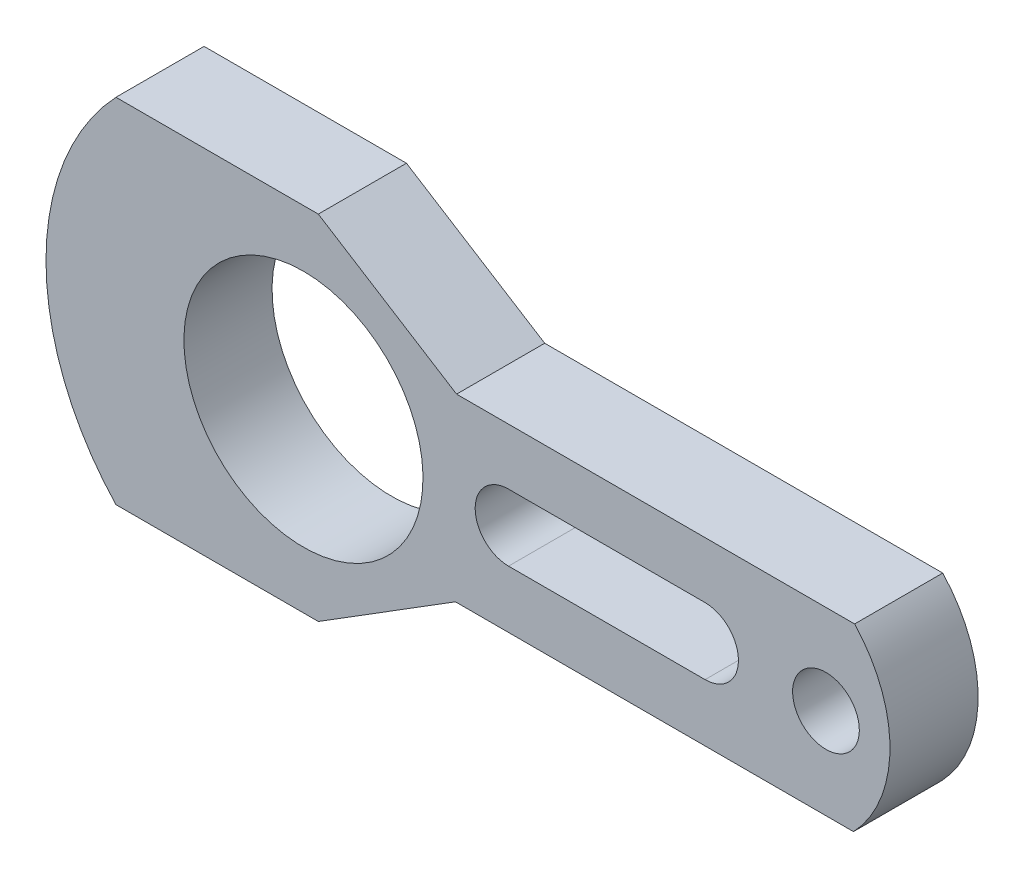
ISO-10303-21;
HEADER;
FILE_DESCRIPTION(('STEP AP214'),'2;1');
FILE_NAME('part.step','',(''),(''),'','','');
FILE_SCHEMA(('AUTOMOTIVE_DESIGN { 1 0 10303 214 1 1 1 1 }'));
ENDSEC;
DATA;
#1=APPLICATION_CONTEXT('core data for automotive mechanical design processes');
#2=APPLICATION_PROTOCOL_DEFINITION('international standard','automotive_design',2000,#1);
#3=PRODUCT_CONTEXT('',#1,'mechanical');
#4=PRODUCT('Part','Part','',(#3));
#5=PRODUCT_RELATED_PRODUCT_CATEGORY('part','',(#4));
#6=PRODUCT_DEFINITION_FORMATION('','',#4);
#7=PRODUCT_DEFINITION_CONTEXT('part definition',#1,'design');
#8=PRODUCT_DEFINITION('design','',#6,#7);
#9=PRODUCT_DEFINITION_SHAPE('','',#8);
#10=(LENGTH_UNIT() NAMED_UNIT(*) SI_UNIT(.MILLI.,.METRE.));
#11=(NAMED_UNIT(*) PLANE_ANGLE_UNIT() SI_UNIT($,.RADIAN.));
#12=(NAMED_UNIT(*) SI_UNIT($,.STERADIAN.) SOLID_ANGLE_UNIT());
#13=UNCERTAINTY_MEASURE_WITH_UNIT(LENGTH_MEASURE(1.E-05),#10,'distance_accuracy_value','');
#14=(GEOMETRIC_REPRESENTATION_CONTEXT(3) GLOBAL_UNCERTAINTY_ASSIGNED_CONTEXT((#13)) GLOBAL_UNIT_ASSIGNED_CONTEXT((#10,
#11,#12)) REPRESENTATION_CONTEXT('',''));
#15=CARTESIAN_POINT('',(0.,0.,0.));
#16=DIRECTION('',(0.,0.,1.));
#17=DIRECTION('',(1.,0.,0.));
#18=AXIS2_PLACEMENT_3D('',#15,#16,#17);
#19=CARTESIAN_POINT('',(258.318,9.51433274175042E-13,50.));
#20=DIRECTION('',(0.,0.,1.));
#21=DIRECTION('',(0.,1.,0.));
#22=AXIS2_PLACEMENT_3D('',#19,#20,#21);
#23=PLANE('',#22);
#24=DIRECTION('',(1.,0.,0.));
#25=VECTOR('',#24,1.);
#26=CARTESIAN_POINT('',(116.332,-18.9229999999996,50.));
#27=LINE('',#26,#25);
#28=CARTESIAN_POINT('',(116.332,-18.9229999999996,50.));
#29=VERTEX_POINT('',#28);
#30=CARTESIAN_POINT('',(227.838,-18.9229999999992,50.));
#31=VERTEX_POINT('',#30);
#32=EDGE_CURVE('E138',#29,#31,#27,.T.);
#33=ORIENTED_EDGE('',*,*,#32,.F.);
#34=CARTESIAN_POINT('',(116.332,4.37396029677882E-13,50.));
#35=DIRECTION('',(0.,0.,1.));
#36=DIRECTION('',(0.,1.,0.));
#37=AXIS2_PLACEMENT_3D('',#34,#35,#36);
#38=CIRCLE('',#37,18.923);
#39=CARTESIAN_POINT('',(116.332,18.9230000000004,50.));
#40=VERTEX_POINT('',#39);
#41=EDGE_CURVE('E129',#40,#29,#38,.T.);
#42=ORIENTED_EDGE('',*,*,#41,.F.);
#43=DIRECTION('',(-1.,0.,0.));
#44=VECTOR('',#43,1.);
#45=CARTESIAN_POINT('',(116.332,18.9230000000004,50.));
#46=LINE('',#45,#44);
#47=CARTESIAN_POINT('',(227.838,18.9230000000008,50.));
#48=VERTEX_POINT('',#47);
#49=EDGE_CURVE('E156',#48,#40,#46,.T.);
#50=ORIENTED_EDGE('',*,*,#49,.F.);
#51=CARTESIAN_POINT('',(227.838,8.41280199523303E-13,50.));
#52=DIRECTION('',(0.,0.,1.));
#53=DIRECTION('',(0.,1.,0.));
#54=AXIS2_PLACEMENT_3D('',#51,#52,#53);
#55=CIRCLE('',#54,18.923);
#56=EDGE_CURVE('E152',#31,#48,#55,.T.);
#57=ORIENTED_EDGE('',*,*,#56,.F.);
#58=EDGE_LOOP('',(#33,#42,#50,#57));
#59=FACE_BOUND('',#58,.T.);
#60=CARTESIAN_POINT('',(258.318,9.51433274175042E-13,50.));
#61=DIRECTION('',(0.,0.,1.));
#62=DIRECTION('',(0.,1.,0.));
#63=AXIS2_PLACEMENT_3D('',#60,#61,#62);
#64=CIRCLE('',#63,74.422);
#65=CARTESIAN_POINT('',(312.023090681709,-51.5208435380222,50.));
#66=VERTEX_POINT('',#65);
#67=CARTESIAN_POINT('',(312.66697325257,50.8411564619797,50.));
#68=VERTEX_POINT('',#67);
#69=EDGE_CURVE('E188',#66,#68,#64,.T.);
#70=ORIENTED_EDGE('',*,*,#69,.T.);
#71=DIRECTION('',(-1.,0.,0.));
#72=VECTOR('',#71,1.);
#73=CARTESIAN_POINT('',(312.66697325257,50.8411564619797,50.));
#74=LINE('',#73,#72);
#75=CARTESIAN_POINT('',(86.8609732525703,50.8411564619789,50.));
#76=VERTEX_POINT('',#75);
#77=EDGE_CURVE('E192',#68,#76,#74,.T.);
#78=ORIENTED_EDGE('',*,*,#77,.T.);
#79=DIRECTION('',(-0.846938172464379,0.531691387952351,0.));
#80=VECTOR('',#79,1.);
#81=CARTESIAN_POINT('',(86.8609732525703,50.8411564619789,50.));
#82=LINE('',#81,#80);
#83=CARTESIAN_POINT('',(8.4341464268587,100.076,50.));
#84=VERTEX_POINT('',#83);
#85=EDGE_CURVE('E196',#76,#84,#82,.T.);
#86=ORIENTED_EDGE('',*,*,#85,.T.);
#87=DIRECTION('',(-1.,0.,0.));
#88=VECTOR('',#87,1.);
#89=CARTESIAN_POINT('',(-106.373853573141,100.076,50.));
#90=LINE('',#89,#88);
#91=CARTESIAN_POINT('',(-106.373853573141,100.076,50.));
#92=VERTEX_POINT('',#91);
#93=EDGE_CURVE('E199',#84,#92,#90,.T.);
#94=ORIENTED_EDGE('',*,*,#93,.T.);
#95=CARTESIAN_POINT('',(0.,0.,50.));
#96=DIRECTION('',(0.,0.,1.));
#97=DIRECTION('',(0.,1.,0.));
#98=AXIS2_PLACEMENT_3D('',#95,#96,#97);
#99=CIRCLE('',#98,146.05);
#100=CARTESIAN_POINT('',(-106.37385357314,-100.076,50.));
#101=VERTEX_POINT('',#100);
#102=EDGE_CURVE('E202',#92,#101,#99,.T.);
#103=ORIENTED_EDGE('',*,*,#102,.T.);
#104=DIRECTION('',(1.,0.,0.));
#105=VECTOR('',#104,1.);
#106=CARTESIAN_POINT('',(-106.37385357314,-100.076,50.));
#107=LINE('',#106,#105);
#108=CARTESIAN_POINT('',(8.43414642685957,-100.076,50.));
#109=VERTEX_POINT('',#108);
#110=EDGE_CURVE('E205',#101,#109,#107,.T.);
#111=ORIENTED_EDGE('',*,*,#110,.T.);
#112=DIRECTION('',(0.848288265915424,0.529534718323739,0.));
#113=VECTOR('',#112,1.);
#114=CARTESIAN_POINT('',(8.43414642685957,-100.076,50.));
#115=LINE('',#114,#113);
#116=CARTESIAN_POINT('',(86.2170906817085,-51.520843538023,50.));
#117=VERTEX_POINT('',#116);
#118=EDGE_CURVE('E208',#109,#117,#115,.T.);
#119=ORIENTED_EDGE('',*,*,#118,.T.);
#120=DIRECTION('',(1.,0.,0.));
#121=VECTOR('',#120,1.);
#122=CARTESIAN_POINT('',(312.023090681709,-51.5208435380222,50.));
#123=LINE('',#122,#121);
#124=EDGE_CURVE('E211',#117,#66,#123,.T.);
#125=ORIENTED_EDGE('',*,*,#124,.T.);
#126=EDGE_LOOP('',(#70,#78,#86,#94,#103,#111,#119,#125));
#127=FACE_BOUND('',#126,.T.);
#128=CARTESIAN_POINT('',(0.,0.,50.));
#129=DIRECTION('',(0.,0.,1.));
#130=DIRECTION('',(0.,1.,0.));
#131=AXIS2_PLACEMENT_3D('',#128,#129,#130);
#132=CIRCLE('',#131,67.818);
#133=CARTESIAN_POINT('',(-2.36785281437664E-13,67.818,50.));
#134=VERTEX_POINT('',#133);
#135=EDGE_CURVE('E180',#134,#134,#132,.T.);
#136=ORIENTED_EDGE('',*,*,#135,.F.);
#137=EDGE_LOOP('',(#136));
#138=FACE_BOUND('',#137,.T.);
#139=CARTESIAN_POINT('',(296.418,1.08912461748972E-12,50.));
#140=DIRECTION('',(0.,0.,1.));
#141=DIRECTION('',(0.,1.,0.));
#142=AXIS2_PLACEMENT_3D('',#139,#140,#141);
#143=CIRCLE('',#142,18.923);
#144=CARTESIAN_POINT('',(296.418,18.9230000000011,50.));
#145=VERTEX_POINT('',#144);
#146=EDGE_CURVE('E164',#145,#145,#143,.T.);
#147=ORIENTED_EDGE('',*,*,#146,.F.);
#148=EDGE_LOOP('',(#147));
#149=FACE_BOUND('',#148,.T.);
#150=ADVANCED_FACE('F39',(#59,#127,#138,#149),#23,.T.);
#151=CARTESIAN_POINT('',(258.318,9.51433274175042E-13,0.));
#152=DIRECTION('',(0.,0.,1.));
#153=DIRECTION('',(0.,1.,0.));
#154=AXIS2_PLACEMENT_3D('',#151,#152,#153);
#155=PLANE('',#154);
#156=CARTESIAN_POINT('',(116.332,4.37396029677882E-13,0.));
#157=DIRECTION('',(0.,0.,1.));
#158=DIRECTION('',(0.,1.,0.));
#159=AXIS2_PLACEMENT_3D('',#156,#157,#158);
#160=CIRCLE('',#159,18.923);
#161=CARTESIAN_POINT('',(116.332,18.9230000000004,0.));
#162=VERTEX_POINT('',#161);
#163=CARTESIAN_POINT('',(116.332,-18.9229999999996,0.));
#164=VERTEX_POINT('',#163);
#165=EDGE_CURVE('E63',#162,#164,#160,.T.);
#166=ORIENTED_EDGE('',*,*,#165,.T.);
#167=DIRECTION('',(1.,0.,0.));
#168=VECTOR('',#167,1.);
#169=CARTESIAN_POINT('',(116.332,-18.9229999999996,0.));
#170=LINE('',#169,#168);
#171=CARTESIAN_POINT('',(227.838,-18.9229999999992,0.));
#172=VERTEX_POINT('',#171);
#173=EDGE_CURVE('E145',#164,#172,#170,.T.);
#174=ORIENTED_EDGE('',*,*,#173,.T.);
#175=CARTESIAN_POINT('',(227.838,8.41280199523303E-13,0.));
#176=DIRECTION('',(0.,0.,1.));
#177=DIRECTION('',(0.,1.,0.));
#178=AXIS2_PLACEMENT_3D('',#175,#176,#177);
#179=CIRCLE('',#178,18.923);
#180=CARTESIAN_POINT('',(227.838,18.9230000000008,0.));
#181=VERTEX_POINT('',#180);
#182=EDGE_CURVE('E167',#172,#181,#179,.T.);
#183=ORIENTED_EDGE('',*,*,#182,.T.);
#184=DIRECTION('',(-1.,0.,0.));
#185=VECTOR('',#184,1.);
#186=CARTESIAN_POINT('',(116.332,18.9230000000004,0.));
#187=LINE('',#186,#185);
#188=EDGE_CURVE('E139',#181,#162,#187,.T.);
#189=ORIENTED_EDGE('',*,*,#188,.T.);
#190=EDGE_LOOP('',(#166,#174,#183,#189));
#191=FACE_BOUND('',#190,.T.);
#192=CARTESIAN_POINT('',(258.318,9.51433274175042E-13,0.));
#193=DIRECTION('',(0.,0.,1.));
#194=DIRECTION('',(0.,1.,0.));
#195=AXIS2_PLACEMENT_3D('',#192,#193,#194);
#196=CIRCLE('',#195,74.422);
#197=CARTESIAN_POINT('',(312.023090681709,-51.5208435380222,0.));
#198=VERTEX_POINT('',#197);
#199=CARTESIAN_POINT('',(312.66697325257,50.8411564619797,0.));
#200=VERTEX_POINT('',#199);
#201=EDGE_CURVE('E184',#198,#200,#196,.T.);
#202=ORIENTED_EDGE('',*,*,#201,.F.);
#203=DIRECTION('',(1.,0.,0.));
#204=VECTOR('',#203,1.);
#205=CARTESIAN_POINT('',(312.023090681709,-51.5208435380222,0.));
#206=LINE('',#205,#204);
#207=CARTESIAN_POINT('',(86.2170906817085,-51.520843538023,0.));
#208=VERTEX_POINT('',#207);
#209=EDGE_CURVE('E193',#208,#198,#206,.T.);
#210=ORIENTED_EDGE('',*,*,#209,.F.);
#211=DIRECTION('',(0.848288265915424,0.529534718323739,0.));
#212=VECTOR('',#211,1.);
#213=CARTESIAN_POINT('',(8.43414642685957,-100.076,0.));
#214=LINE('',#213,#212);
#215=CARTESIAN_POINT('',(8.43414642685957,-100.076,0.));
#216=VERTEX_POINT('',#215);
#217=EDGE_CURVE('E233',#216,#208,#214,.T.);
#218=ORIENTED_EDGE('',*,*,#217,.F.);
#219=DIRECTION('',(1.,0.,0.));
#220=VECTOR('',#219,1.);
#221=CARTESIAN_POINT('',(-106.37385357314,-100.076,0.));
#222=LINE('',#221,#220);
#223=CARTESIAN_POINT('',(-106.37385357314,-100.076,0.));
#224=VERTEX_POINT('',#223);
#225=EDGE_CURVE('E230',#224,#216,#222,.T.);
#226=ORIENTED_EDGE('',*,*,#225,.F.);
#227=CARTESIAN_POINT('',(0.,0.,0.));
#228=DIRECTION('',(0.,0.,1.));
#229=DIRECTION('',(0.,1.,0.));
#230=AXIS2_PLACEMENT_3D('',#227,#228,#229);
#231=CIRCLE('',#230,146.05);
#232=CARTESIAN_POINT('',(-106.373853573141,100.076,0.));
#233=VERTEX_POINT('',#232);
#234=EDGE_CURVE('E227',#233,#224,#231,.T.);
#235=ORIENTED_EDGE('',*,*,#234,.F.);
#236=DIRECTION('',(-1.,0.,0.));
#237=VECTOR('',#236,1.);
#238=CARTESIAN_POINT('',(-106.373853573141,100.076,0.));
#239=LINE('',#238,#237);
#240=CARTESIAN_POINT('',(8.4341464268587,100.076,0.));
#241=VERTEX_POINT('',#240);
#242=EDGE_CURVE('E224',#241,#233,#239,.T.);
#243=ORIENTED_EDGE('',*,*,#242,.F.);
#244=DIRECTION('',(-0.846938172464379,0.531691387952351,0.));
#245=VECTOR('',#244,1.);
#246=CARTESIAN_POINT('',(86.8609732525703,50.8411564619789,0.));
#247=LINE('',#246,#245);
#248=CARTESIAN_POINT('',(86.8609732525703,50.8411564619789,0.));
#249=VERTEX_POINT('',#248);
#250=EDGE_CURVE('E221',#249,#241,#247,.T.);
#251=ORIENTED_EDGE('',*,*,#250,.F.);
#252=DIRECTION('',(-1.,0.,0.));
#253=VECTOR('',#252,1.);
#254=CARTESIAN_POINT('',(312.66697325257,50.8411564619797,0.));
#255=LINE('',#254,#253);
#256=EDGE_CURVE('E218',#200,#249,#255,.T.);
#257=ORIENTED_EDGE('',*,*,#256,.F.);
#258=EDGE_LOOP('',(#202,#210,#218,#226,#235,#243,#251,#257));
#259=FACE_BOUND('',#258,.T.);
#260=CARTESIAN_POINT('',(0.,0.,0.));
#261=DIRECTION('',(0.,0.,1.));
#262=DIRECTION('',(0.,1.,0.));
#263=AXIS2_PLACEMENT_3D('',#260,#261,#262);
#264=CIRCLE('',#263,67.818);
#265=CARTESIAN_POINT('',(-2.36785281437664E-13,67.818,0.));
#266=VERTEX_POINT('',#265);
#267=EDGE_CURVE('E147',#266,#266,#264,.T.);
#268=ORIENTED_EDGE('',*,*,#267,.T.);
#269=EDGE_LOOP('',(#268));
#270=FACE_BOUND('',#269,.T.);
#271=CARTESIAN_POINT('',(296.418,1.08912461748972E-12,0.));
#272=DIRECTION('',(0.,0.,1.));
#273=DIRECTION('',(0.,1.,0.));
#274=AXIS2_PLACEMENT_3D('',#271,#272,#273);
#275=CIRCLE('',#274,18.923);
#276=CARTESIAN_POINT('',(296.418,18.9230000000011,0.));
#277=VERTEX_POINT('',#276);
#278=EDGE_CURVE('E336',#277,#277,#275,.T.);
#279=ORIENTED_EDGE('',*,*,#278,.T.);
#280=EDGE_LOOP('',(#279));
#281=FACE_BOUND('',#280,.T.);
#282=ADVANCED_FACE('F272',(#191,#259,#270,#281),#155,.F.);
#283=CARTESIAN_POINT('',(258.318,9.51433274175042E-13,50.));
#284=DIRECTION('',(0.,0.,-1.));
#285=DIRECTION('',(0.,-1.,0.));
#286=AXIS2_PLACEMENT_3D('',#283,#284,#285);
#287=CYLINDRICAL_SURFACE('',#286,74.422);
#288=ORIENTED_EDGE('',*,*,#201,.T.);
#289=DIRECTION('',(0.,0.,-1.));
#290=VECTOR('',#289,1.);
#291=CARTESIAN_POINT('',(312.66697325257,50.8411564619797,50.));
#292=LINE('',#291,#290);
#293=EDGE_CURVE('E11',#68,#200,#292,.T.);
#294=ORIENTED_EDGE('',*,*,#293,.F.);
#295=ORIENTED_EDGE('',*,*,#69,.F.);
#296=DIRECTION('',(0.,0.,-1.));
#297=VECTOR('',#296,1.);
#298=CARTESIAN_POINT('',(312.023090681709,-51.5208435380222,50.));
#299=LINE('',#298,#297);
#300=EDGE_CURVE('E214',#66,#198,#299,.T.);
#301=ORIENTED_EDGE('',*,*,#300,.T.);
#302=EDGE_LOOP('',(#288,#294,#295,#301));
#303=FACE_BOUND('',#302,.T.);
#304=ADVANCED_FACE('F41',(#303),#287,.T.);
#305=CARTESIAN_POINT('',(312.66697325257,50.8411564619797,50.));
#306=DIRECTION('',(0.,-1.,0.));
#307=DIRECTION('',(0.,0.,1.));
#308=AXIS2_PLACEMENT_3D('',#305,#306,#307);
#309=PLANE('',#308);
#310=ORIENTED_EDGE('',*,*,#256,.T.);
#311=DIRECTION('',(0.,0.,-1.));
#312=VECTOR('',#311,1.);
#313=CARTESIAN_POINT('',(86.8609732525703,50.8411564619789,50.));
#314=LINE('',#313,#312);
#315=EDGE_CURVE('E48',#76,#249,#314,.T.);
#316=ORIENTED_EDGE('',*,*,#315,.F.);
#317=ORIENTED_EDGE('',*,*,#77,.F.);
#318=ORIENTED_EDGE('',*,*,#293,.T.);
#319=EDGE_LOOP('',(#310,#316,#317,#318));
#320=FACE_BOUND('',#319,.T.);
#321=ADVANCED_FACE('F289',(#320),#309,.F.);
#322=CARTESIAN_POINT('',(86.8609732525703,50.8411564619789,50.));
#323=DIRECTION('',(-0.531691387952351,-0.846938172464379,0.));
#324=DIRECTION('',(0.846938172464379,-0.531691387952351,0.));
#325=AXIS2_PLACEMENT_3D('',#322,#323,#324);
#326=PLANE('',#325);
#327=ORIENTED_EDGE('',*,*,#250,.T.);
#328=DIRECTION('',(0.,0.,-1.));
#329=VECTOR('',#328,1.);
#330=CARTESIAN_POINT('',(8.4341464268587,100.076,50.));
#331=LINE('',#330,#329);
#332=EDGE_CURVE('E257',#84,#241,#331,.T.);
#333=ORIENTED_EDGE('',*,*,#332,.F.);
#334=ORIENTED_EDGE('',*,*,#85,.F.);
#335=ORIENTED_EDGE('',*,*,#315,.T.);
#336=EDGE_LOOP('',(#327,#333,#334,#335));
#337=FACE_BOUND('',#336,.T.);
#338=ADVANCED_FACE('F266',(#337),#326,.F.);
#339=CARTESIAN_POINT('',(-106.373853573141,100.076,50.));
#340=DIRECTION('',(0.,-1.,0.));
#341=DIRECTION('',(1.,0.,0.));
#342=AXIS2_PLACEMENT_3D('',#339,#340,#341);
#343=PLANE('',#342);
#344=ORIENTED_EDGE('',*,*,#242,.T.);
#345=DIRECTION('',(0.,0.,-1.));
#346=VECTOR('',#345,1.);
#347=CARTESIAN_POINT('',(-106.373853573141,100.076,50.));
#348=LINE('',#347,#346);
#349=EDGE_CURVE('E253',#92,#233,#348,.T.);
#350=ORIENTED_EDGE('',*,*,#349,.F.);
#351=ORIENTED_EDGE('',*,*,#93,.F.);
#352=ORIENTED_EDGE('',*,*,#332,.T.);
#353=EDGE_LOOP('',(#344,#350,#351,#352));
#354=FACE_BOUND('',#353,.T.);
#355=ADVANCED_FACE('F278',(#354),#343,.F.);
#356=CARTESIAN_POINT('',(0.,0.,50.));
#357=DIRECTION('',(0.,0.,-1.));
#358=DIRECTION('',(0.,-1.,0.));
#359=AXIS2_PLACEMENT_3D('',#356,#357,#358);
#360=CYLINDRICAL_SURFACE('',#359,146.05);
#361=ORIENTED_EDGE('',*,*,#234,.T.);
#362=DIRECTION('',(0.,0.,-1.));
#363=VECTOR('',#362,1.);
#364=CARTESIAN_POINT('',(-106.37385357314,-100.076,50.));
#365=LINE('',#364,#363);
#366=EDGE_CURVE('E249',#101,#224,#365,.T.);
#367=ORIENTED_EDGE('',*,*,#366,.F.);
#368=ORIENTED_EDGE('',*,*,#102,.F.);
#369=ORIENTED_EDGE('',*,*,#349,.T.);
#370=EDGE_LOOP('',(#361,#367,#368,#369));
#371=FACE_BOUND('',#370,.T.);
#372=ADVANCED_FACE('F282',(#371),#360,.T.);
#373=CARTESIAN_POINT('',(-106.37385357314,-100.076,50.));
#374=DIRECTION('',(0.,1.,0.));
#375=DIRECTION('',(-1.,0.,0.));
#376=AXIS2_PLACEMENT_3D('',#373,#374,#375);
#377=PLANE('',#376);
#378=ORIENTED_EDGE('',*,*,#225,.T.);
#379=DIRECTION('',(0.,0.,-1.));
#380=VECTOR('',#379,1.);
#381=CARTESIAN_POINT('',(8.43414642685957,-100.076,50.));
#382=LINE('',#381,#380);
#383=EDGE_CURVE('E245',#109,#216,#382,.T.);
#384=ORIENTED_EDGE('',*,*,#383,.F.);
#385=ORIENTED_EDGE('',*,*,#110,.F.);
#386=ORIENTED_EDGE('',*,*,#366,.T.);
#387=EDGE_LOOP('',(#378,#384,#385,#386));
#388=FACE_BOUND('',#387,.T.);
#389=ADVANCED_FACE('F302',(#388),#377,.F.);
#390=CARTESIAN_POINT('',(8.43414642685957,-100.076,50.));
#391=DIRECTION('',(-0.529534718323739,0.848288265915425,0.));
#392=DIRECTION('',(-0.848288265915425,-0.529534718323739,0.));
#393=AXIS2_PLACEMENT_3D('',#390,#391,#392);
#394=PLANE('',#393);
#395=ORIENTED_EDGE('',*,*,#217,.T.);
#396=DIRECTION('',(0.,0.,-1.));
#397=VECTOR('',#396,1.);
#398=CARTESIAN_POINT('',(86.2170906817085,-51.520843538023,50.));
#399=LINE('',#398,#397);
#400=EDGE_CURVE('E241',#117,#208,#399,.T.);
#401=ORIENTED_EDGE('',*,*,#400,.F.);
#402=ORIENTED_EDGE('',*,*,#118,.F.);
#403=ORIENTED_EDGE('',*,*,#383,.T.);
#404=EDGE_LOOP('',(#395,#401,#402,#403));
#405=FACE_BOUND('',#404,.T.);
#406=ADVANCED_FACE('F300',(#405),#394,.F.);
#407=CARTESIAN_POINT('',(312.023090681709,-51.5208435380222,50.));
#408=DIRECTION('',(0.,1.,0.));
#409=DIRECTION('',(-1.,0.,0.));
#410=AXIS2_PLACEMENT_3D('',#407,#408,#409);
#411=PLANE('',#410);
#412=ORIENTED_EDGE('',*,*,#209,.T.);
#413=ORIENTED_EDGE('',*,*,#300,.F.);
#414=ORIENTED_EDGE('',*,*,#124,.F.);
#415=ORIENTED_EDGE('',*,*,#400,.T.);
#416=EDGE_LOOP('',(#412,#413,#414,#415));
#417=FACE_BOUND('',#416,.T.);
#418=ADVANCED_FACE('F295',(#417),#411,.F.);
#419=CARTESIAN_POINT('',(0.,0.,50.));
#420=DIRECTION('',(0.,0.,-1.));
#421=DIRECTION('',(0.,-1.,0.));
#422=AXIS2_PLACEMENT_3D('',#419,#420,#421);
#423=CYLINDRICAL_SURFACE('',#422,67.818);
#424=ORIENTED_EDGE('',*,*,#135,.T.);
#425=EDGE_LOOP('',(#424));
#426=FACE_BOUND('',#425,.T.);
#427=ORIENTED_EDGE('',*,*,#267,.F.);
#428=EDGE_LOOP('',(#427));
#429=FACE_BOUND('',#428,.T.);
#430=ADVANCED_FACE('F319',(#426,#429),#423,.F.);
#431=CARTESIAN_POINT('',(116.332,4.37396029677882E-13,50.));
#432=DIRECTION('',(0.,0.,-1.));
#433=DIRECTION('',(0.,-1.,0.));
#434=AXIS2_PLACEMENT_3D('',#431,#432,#433);
#435=CYLINDRICAL_SURFACE('',#434,18.923);
#436=ORIENTED_EDGE('',*,*,#165,.F.);
#437=DIRECTION('',(0.,0.,-1.));
#438=VECTOR('',#437,1.);
#439=CARTESIAN_POINT('',(116.332,18.9230000000004,50.));
#440=LINE('',#439,#438);
#441=EDGE_CURVE('E133',#40,#162,#440,.T.);
#442=ORIENTED_EDGE('',*,*,#441,.F.);
#443=ORIENTED_EDGE('',*,*,#41,.T.);
#444=DIRECTION('',(0.,0.,-1.));
#445=VECTOR('',#444,1.);
#446=CARTESIAN_POINT('',(116.332,-18.9229999999996,50.));
#447=LINE('',#446,#445);
#448=EDGE_CURVE('E132',#29,#164,#447,.T.);
#449=ORIENTED_EDGE('',*,*,#448,.T.);
#450=EDGE_LOOP('',(#436,#442,#443,#449));
#451=FACE_BOUND('',#450,.T.);
#452=ADVANCED_FACE('F131',(#451),#435,.F.);
#453=CARTESIAN_POINT('',(116.332,-18.9229999999996,50.));
#454=DIRECTION('',(0.,1.,0.));
#455=DIRECTION('',(-1.,0.,0.));
#456=AXIS2_PLACEMENT_3D('',#453,#454,#455);
#457=PLANE('',#456);
#458=ORIENTED_EDGE('',*,*,#173,.F.);
#459=ORIENTED_EDGE('',*,*,#448,.F.);
#460=ORIENTED_EDGE('',*,*,#32,.T.);
#461=DIRECTION('',(0.,0.,-1.));
#462=VECTOR('',#461,1.);
#463=CARTESIAN_POINT('',(227.838,-18.9229999999992,50.));
#464=LINE('',#463,#462);
#465=EDGE_CURVE('E148',#31,#172,#464,.T.);
#466=ORIENTED_EDGE('',*,*,#465,.T.);
#467=EDGE_LOOP('',(#458,#459,#460,#466));
#468=FACE_BOUND('',#467,.T.);
#469=ADVANCED_FACE('F142',(#468),#457,.T.);
#470=CARTESIAN_POINT('',(227.838,8.41280199523303E-13,50.));
#471=DIRECTION('',(0.,0.,-1.));
#472=DIRECTION('',(0.,-1.,0.));
#473=AXIS2_PLACEMENT_3D('',#470,#471,#472);
#474=CYLINDRICAL_SURFACE('',#473,18.923);
#475=ORIENTED_EDGE('',*,*,#182,.F.);
#476=ORIENTED_EDGE('',*,*,#465,.F.);
#477=ORIENTED_EDGE('',*,*,#56,.T.);
#478=DIRECTION('',(0.,0.,-1.));
#479=VECTOR('',#478,1.);
#480=CARTESIAN_POINT('',(227.838,18.9230000000008,50.));
#481=LINE('',#480,#479);
#482=EDGE_CURVE('E55',#48,#181,#481,.T.);
#483=ORIENTED_EDGE('',*,*,#482,.T.);
#484=EDGE_LOOP('',(#475,#476,#477,#483));
#485=FACE_BOUND('',#484,.T.);
#486=ADVANCED_FACE('F352',(#485),#474,.F.);
#487=CARTESIAN_POINT('',(116.332,18.9230000000004,50.));
#488=DIRECTION('',(0.,-1.,0.));
#489=DIRECTION('',(1.,0.,0.));
#490=AXIS2_PLACEMENT_3D('',#487,#488,#489);
#491=PLANE('',#490);
#492=ORIENTED_EDGE('',*,*,#188,.F.);
#493=ORIENTED_EDGE('',*,*,#482,.F.);
#494=ORIENTED_EDGE('',*,*,#49,.T.);
#495=ORIENTED_EDGE('',*,*,#441,.T.);
#496=EDGE_LOOP('',(#492,#493,#494,#495));
#497=FACE_BOUND('',#496,.T.);
#498=ADVANCED_FACE('F347',(#497),#491,.T.);
#499=CARTESIAN_POINT('',(296.418,1.08912461748972E-12,50.));
#500=DIRECTION('',(0.,0.,-1.));
#501=DIRECTION('',(0.,-1.,0.));
#502=AXIS2_PLACEMENT_3D('',#499,#500,#501);
#503=CYLINDRICAL_SURFACE('',#502,18.923);
#504=ORIENTED_EDGE('',*,*,#146,.T.);
#505=EDGE_LOOP('',(#504));
#506=FACE_BOUND('',#505,.T.);
#507=ORIENTED_EDGE('',*,*,#278,.F.);
#508=EDGE_LOOP('',(#507));
#509=FACE_BOUND('',#508,.T.);
#510=ADVANCED_FACE('F344',(#506,#509),#503,.F.);
#511=CLOSED_SHELL('',(#150,#282,#304,#321,#338,#355,#372,#389,#406,#418,#430,#452,#469,#486,
#498,#510));
#512=MANIFOLD_SOLID_BREP('B2',#511);
#513=ADVANCED_BREP_SHAPE_REPRESENTATION('',(#18,#512),#14);
#514=SHAPE_DEFINITION_REPRESENTATION(#9,#513);
ENDSEC;
END-ISO-10303-21;
